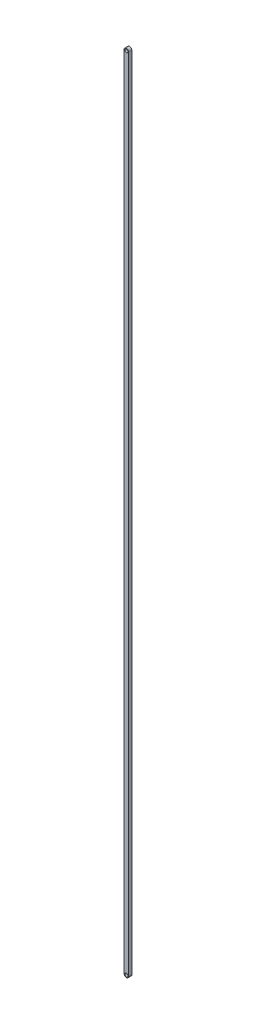
ISO-10303-21;
HEADER;
FILE_DESCRIPTION(('STEP AP214'),'2;1');
FILE_NAME('part.step','',(''),(''),'','','');
FILE_SCHEMA(('AUTOMOTIVE_DESIGN { 1 0 10303 214 1 1 1 1 }'));
ENDSEC;
DATA;
#1=APPLICATION_CONTEXT('core data for automotive mechanical design processes');
#2=APPLICATION_PROTOCOL_DEFINITION('international standard','automotive_design',2000,#1);
#3=PRODUCT_CONTEXT('',#1,'mechanical');
#4=PRODUCT('Part','Part','',(#3));
#5=PRODUCT_RELATED_PRODUCT_CATEGORY('part','',(#4));
#6=PRODUCT_DEFINITION_FORMATION('','',#4);
#7=PRODUCT_DEFINITION_CONTEXT('part definition',#1,'design');
#8=PRODUCT_DEFINITION('design','',#6,#7);
#9=PRODUCT_DEFINITION_SHAPE('','',#8);
#10=(LENGTH_UNIT() NAMED_UNIT(*) SI_UNIT(.MILLI.,.METRE.));
#11=(NAMED_UNIT(*) PLANE_ANGLE_UNIT() SI_UNIT($,.RADIAN.));
#12=(NAMED_UNIT(*) SI_UNIT($,.STERADIAN.) SOLID_ANGLE_UNIT());
#13=UNCERTAINTY_MEASURE_WITH_UNIT(LENGTH_MEASURE(1.E-05),#10,'distance_accuracy_value','');
#14=(GEOMETRIC_REPRESENTATION_CONTEXT(3) GLOBAL_UNCERTAINTY_ASSIGNED_CONTEXT((#13)) GLOBAL_UNIT_ASSIGNED_CONTEXT((#10,
#11,#12)) REPRESENTATION_CONTEXT('',''));
#15=CARTESIAN_POINT('',(0.,0.,0.));
#16=DIRECTION('',(0.,0.,1.));
#17=DIRECTION('',(1.,0.,0.));
#18=AXIS2_PLACEMENT_3D('',#15,#16,#17);
#19=CARTESIAN_POINT('',(0.,0.,2.5));
#20=DIRECTION('',(0.,0.,1.));
#21=DIRECTION('',(1.,0.,0.));
#22=AXIS2_PLACEMENT_3D('',#19,#20,#21);
#23=PLANE('',#22);
#24=CARTESIAN_POINT('',(0.,0.,2.5));
#25=DIRECTION('',(0.,0.,1.));
#26=DIRECTION('',(1.,0.,0.));
#27=AXIS2_PLACEMENT_3D('',#24,#25,#26);
#28=CIRCLE('',#27,2.5);
#29=CARTESIAN_POINT('',(2.5,0.,2.5));
#30=VERTEX_POINT('',#29);
#31=EDGE_CURVE('E118',#30,#30,#28,.T.);
#32=ORIENTED_EDGE('',*,*,#31,.F.);
#33=EDGE_LOOP('',(#32));
#34=FACE_BOUND('',#33,.T.);
#35=CARTESIAN_POINT('',(0.,0.,2.5));
#36=DIRECTION('',(0.,0.,1.));
#37=DIRECTION('',(1.,0.,0.));
#38=AXIS2_PLACEMENT_3D('',#35,#36,#37);
#39=CIRCLE('',#38,3.5);
#40=CARTESIAN_POINT('',(3.5,0.,2.5));
#41=VERTEX_POINT('',#40);
#42=CARTESIAN_POINT('',(-3.5,0.,2.5));
#43=VERTEX_POINT('',#42);
#44=EDGE_CURVE('E98',#41,#43,#39,.T.);
#45=ORIENTED_EDGE('',*,*,#44,.T.);
#46=DIRECTION('',(0.,-1.,0.));
#47=VECTOR('',#46,1.);
#48=CARTESIAN_POINT('',(-3.5,0.,2.5));
#49=LINE('',#48,#47);
#50=CARTESIAN_POINT('',(-3.49999999999985,-1244.,2.5));
#51=VERTEX_POINT('',#50);
#52=EDGE_CURVE('E93',#43,#51,#49,.T.);
#53=ORIENTED_EDGE('',*,*,#52,.T.);
#54=CARTESIAN_POINT('',(1.52346061813931E-13,-1244.,2.5));
#55=DIRECTION('',(0.,0.,1.));
#56=DIRECTION('',(1.,0.,0.));
#57=AXIS2_PLACEMENT_3D('',#54,#55,#56);
#58=CIRCLE('',#57,3.5);
#59=CARTESIAN_POINT('',(3.50000000000015,-1244.,2.5));
#60=VERTEX_POINT('',#59);
#61=EDGE_CURVE('E96',#51,#60,#58,.T.);
#62=ORIENTED_EDGE('',*,*,#61,.T.);
#63=DIRECTION('',(0.,1.,0.));
#64=VECTOR('',#63,1.);
#65=CARTESIAN_POINT('',(3.5,0.,2.5));
#66=LINE('',#65,#64);
#67=EDGE_CURVE('E63',#60,#41,#66,.T.);
#68=ORIENTED_EDGE('',*,*,#67,.T.);
#69=EDGE_LOOP('',(#45,#53,#62,#68));
#70=FACE_BOUND('',#69,.T.);
#71=CARTESIAN_POINT('',(1.52346061813931E-13,-1244.,2.5));
#72=DIRECTION('',(0.,0.,1.));
#73=DIRECTION('',(1.,0.,0.));
#74=AXIS2_PLACEMENT_3D('',#71,#72,#73);
#75=CIRCLE('',#74,2.49999999999997);
#76=CARTESIAN_POINT('',(2.50000000000012,-1244.,2.5));
#77=VERTEX_POINT('',#76);
#78=EDGE_CURVE('E140',#77,#77,#75,.T.);
#79=ORIENTED_EDGE('',*,*,#78,.F.);
#80=EDGE_LOOP('',(#79));
#81=FACE_BOUND('',#80,.T.);
#82=ADVANCED_FACE('F45',(#34,#70,#81),#23,.T.);
#83=CARTESIAN_POINT('',(0.,0.,-2.5));
#84=DIRECTION('',(0.,0.,1.));
#85=DIRECTION('',(1.,0.,0.));
#86=AXIS2_PLACEMENT_3D('',#83,#84,#85);
#87=PLANE('',#86);
#88=CARTESIAN_POINT('',(0.,0.,-2.5));
#89=DIRECTION('',(0.,0.,1.));
#90=DIRECTION('',(1.,0.,0.));
#91=AXIS2_PLACEMENT_3D('',#88,#89,#90);
#92=CIRCLE('',#91,3.5);
#93=CARTESIAN_POINT('',(3.5,0.,-2.5));
#94=VERTEX_POINT('',#93);
#95=CARTESIAN_POINT('',(-3.5,0.,-2.5));
#96=VERTEX_POINT('',#95);
#97=EDGE_CURVE('E114',#94,#96,#92,.T.);
#98=ORIENTED_EDGE('',*,*,#97,.F.);
#99=DIRECTION('',(0.,1.,0.));
#100=VECTOR('',#99,1.);
#101=CARTESIAN_POINT('',(3.5,0.,-2.5));
#102=LINE('',#101,#100);
#103=CARTESIAN_POINT('',(3.50000000000015,-1244.,-2.5));
#104=VERTEX_POINT('',#103);
#105=EDGE_CURVE('E86',#104,#94,#102,.T.);
#106=ORIENTED_EDGE('',*,*,#105,.F.);
#107=CARTESIAN_POINT('',(1.52346061813931E-13,-1244.,-2.5));
#108=DIRECTION('',(0.,0.,1.));
#109=DIRECTION('',(1.,0.,0.));
#110=AXIS2_PLACEMENT_3D('',#107,#108,#109);
#111=CIRCLE('',#110,3.5);
#112=CARTESIAN_POINT('',(-3.49999999999985,-1244.,-2.5));
#113=VERTEX_POINT('',#112);
#114=EDGE_CURVE('E80',#113,#104,#111,.T.);
#115=ORIENTED_EDGE('',*,*,#114,.F.);
#116=DIRECTION('',(0.,-1.,0.));
#117=VECTOR('',#116,1.);
#118=CARTESIAN_POINT('',(-3.5,0.,-2.5));
#119=LINE('',#118,#117);
#120=EDGE_CURVE('E103',#96,#113,#119,.T.);
#121=ORIENTED_EDGE('',*,*,#120,.F.);
#122=EDGE_LOOP('',(#98,#106,#115,#121));
#123=FACE_BOUND('',#122,.T.);
#124=CARTESIAN_POINT('',(0.,0.,-2.5));
#125=DIRECTION('',(0.,0.,1.));
#126=DIRECTION('',(1.,0.,0.));
#127=AXIS2_PLACEMENT_3D('',#124,#125,#126);
#128=CIRCLE('',#127,2.5);
#129=CARTESIAN_POINT('',(2.5,0.,-2.5));
#130=VERTEX_POINT('',#129);
#131=EDGE_CURVE('E136',#130,#130,#128,.T.);
#132=ORIENTED_EDGE('',*,*,#131,.T.);
#133=EDGE_LOOP('',(#132));
#134=FACE_BOUND('',#133,.T.);
#135=CARTESIAN_POINT('',(1.52346061813931E-13,-1244.,-2.5));
#136=DIRECTION('',(0.,0.,1.));
#137=DIRECTION('',(1.,0.,0.));
#138=AXIS2_PLACEMENT_3D('',#135,#136,#137);
#139=CIRCLE('',#138,2.49999999999997);
#140=CARTESIAN_POINT('',(2.50000000000012,-1244.,-2.5));
#141=VERTEX_POINT('',#140);
#142=EDGE_CURVE('E144',#141,#141,#139,.T.);
#143=ORIENTED_EDGE('',*,*,#142,.T.);
#144=EDGE_LOOP('',(#143));
#145=FACE_BOUND('',#144,.T.);
#146=ADVANCED_FACE('F131',(#123,#134,#145),#87,.F.);
#147=CARTESIAN_POINT('',(0.,0.,2.5));
#148=DIRECTION('',(0.,0.,-1.));
#149=DIRECTION('',(-1.,0.,0.));
#150=AXIS2_PLACEMENT_3D('',#147,#148,#149);
#151=CYLINDRICAL_SURFACE('',#150,3.5);
#152=ORIENTED_EDGE('',*,*,#97,.T.);
#153=DIRECTION('',(0.,0.,-1.));
#154=VECTOR('',#153,1.);
#155=CARTESIAN_POINT('',(-3.5,0.,2.5));
#156=LINE('',#155,#154);
#157=EDGE_CURVE('E11',#43,#96,#156,.T.);
#158=ORIENTED_EDGE('',*,*,#157,.F.);
#159=ORIENTED_EDGE('',*,*,#44,.F.);
#160=DIRECTION('',(0.,0.,-1.));
#161=VECTOR('',#160,1.);
#162=CARTESIAN_POINT('',(3.5,0.,2.5));
#163=LINE('',#162,#161);
#164=EDGE_CURVE('E110',#41,#94,#163,.T.);
#165=ORIENTED_EDGE('',*,*,#164,.T.);
#166=EDGE_LOOP('',(#152,#158,#159,#165));
#167=FACE_BOUND('',#166,.T.);
#168=ADVANCED_FACE('F47',(#167),#151,.T.);
#169=CARTESIAN_POINT('',(-3.5,0.,2.5));
#170=DIRECTION('',(1.,0.,0.));
#171=DIRECTION('',(0.,1.,0.));
#172=AXIS2_PLACEMENT_3D('',#169,#170,#171);
#173=PLANE('',#172);
#174=ORIENTED_EDGE('',*,*,#120,.T.);
#175=DIRECTION('',(0.,0.,-1.));
#176=VECTOR('',#175,1.);
#177=CARTESIAN_POINT('',(-3.49999999999985,-1244.,2.5));
#178=LINE('',#177,#176);
#179=EDGE_CURVE('E55',#51,#113,#178,.T.);
#180=ORIENTED_EDGE('',*,*,#179,.F.);
#181=ORIENTED_EDGE('',*,*,#52,.F.);
#182=ORIENTED_EDGE('',*,*,#157,.T.);
#183=EDGE_LOOP('',(#174,#180,#181,#182));
#184=FACE_BOUND('',#183,.T.);
#185=ADVANCED_FACE('F102',(#184),#173,.F.);
#186=CARTESIAN_POINT('',(1.52346061813931E-13,-1244.,2.5));
#187=DIRECTION('',(0.,0.,-1.));
#188=DIRECTION('',(-1.,0.,0.));
#189=AXIS2_PLACEMENT_3D('',#186,#187,#188);
#190=CYLINDRICAL_SURFACE('',#189,3.5);
#191=ORIENTED_EDGE('',*,*,#114,.T.);
#192=DIRECTION('',(0.,0.,-1.));
#193=VECTOR('',#192,1.);
#194=CARTESIAN_POINT('',(3.50000000000015,-1244.,2.5));
#195=LINE('',#194,#193);
#196=EDGE_CURVE('E105',#60,#104,#195,.T.);
#197=ORIENTED_EDGE('',*,*,#196,.F.);
#198=ORIENTED_EDGE('',*,*,#61,.F.);
#199=ORIENTED_EDGE('',*,*,#179,.T.);
#200=EDGE_LOOP('',(#191,#197,#198,#199));
#201=FACE_BOUND('',#200,.T.);
#202=ADVANCED_FACE('F106',(#201),#190,.T.);
#203=CARTESIAN_POINT('',(3.5,0.,2.5));
#204=DIRECTION('',(-1.,0.,0.));
#205=DIRECTION('',(0.,-1.,0.));
#206=AXIS2_PLACEMENT_3D('',#203,#204,#205);
#207=PLANE('',#206);
#208=ORIENTED_EDGE('',*,*,#105,.T.);
#209=ORIENTED_EDGE('',*,*,#164,.F.);
#210=ORIENTED_EDGE('',*,*,#67,.F.);
#211=ORIENTED_EDGE('',*,*,#196,.T.);
#212=EDGE_LOOP('',(#208,#209,#210,#211));
#213=FACE_BOUND('',#212,.T.);
#214=ADVANCED_FACE('F128',(#213),#207,.F.);
#215=CARTESIAN_POINT('',(0.,0.,2.5));
#216=DIRECTION('',(0.,0.,-1.));
#217=DIRECTION('',(-1.,0.,0.));
#218=AXIS2_PLACEMENT_3D('',#215,#216,#217);
#219=CYLINDRICAL_SURFACE('',#218,2.5);
#220=ORIENTED_EDGE('',*,*,#31,.T.);
#221=EDGE_LOOP('',(#220));
#222=FACE_BOUND('',#221,.T.);
#223=ORIENTED_EDGE('',*,*,#131,.F.);
#224=EDGE_LOOP('',(#223));
#225=FACE_BOUND('',#224,.T.);
#226=ADVANCED_FACE('F163',(#222,#225),#219,.F.);
#227=CARTESIAN_POINT('',(1.52346061813931E-13,-1244.,2.5));
#228=DIRECTION('',(0.,0.,-1.));
#229=DIRECTION('',(-1.,0.,0.));
#230=AXIS2_PLACEMENT_3D('',#227,#228,#229);
#231=CYLINDRICAL_SURFACE('',#230,2.49999999999997);
#232=ORIENTED_EDGE('',*,*,#78,.T.);
#233=EDGE_LOOP('',(#232));
#234=FACE_BOUND('',#233,.T.);
#235=ORIENTED_EDGE('',*,*,#142,.F.);
#236=EDGE_LOOP('',(#235));
#237=FACE_BOUND('',#236,.T.);
#238=ADVANCED_FACE('F152',(#234,#237),#231,.F.);
#239=CLOSED_SHELL('',(#82,#146,#168,#185,#202,#214,#226,#238));
#240=MANIFOLD_SOLID_BREP('B2',#239);
#241=ADVANCED_BREP_SHAPE_REPRESENTATION('',(#18,#240),#14);
#242=SHAPE_DEFINITION_REPRESENTATION(#9,#241);
ENDSEC;
END-ISO-10303-21;
